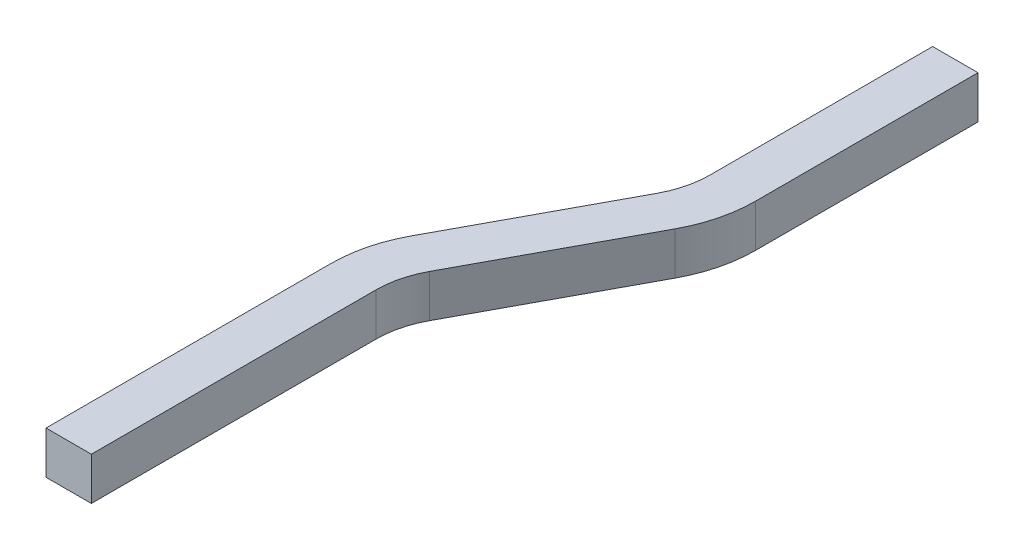
ISO-10303-21;
HEADER;
FILE_DESCRIPTION(('STEP AP214'),'2;1');
FILE_NAME('part.step','',(''),(''),'','','');
FILE_SCHEMA(('AUTOMOTIVE_DESIGN { 1 0 10303 214 1 1 1 1 }'));
ENDSEC;
DATA;
#1=APPLICATION_CONTEXT('core data for automotive mechanical design processes');
#2=APPLICATION_PROTOCOL_DEFINITION('international standard','automotive_design',2000,#1);
#3=PRODUCT_CONTEXT('',#1,'mechanical');
#4=PRODUCT('Part','Part','',(#3));
#5=PRODUCT_RELATED_PRODUCT_CATEGORY('part','',(#4));
#6=PRODUCT_DEFINITION_FORMATION('','',#4);
#7=PRODUCT_DEFINITION_CONTEXT('part definition',#1,'design');
#8=PRODUCT_DEFINITION('design','',#6,#7);
#9=PRODUCT_DEFINITION_SHAPE('','',#8);
#10=(LENGTH_UNIT() NAMED_UNIT(*) SI_UNIT(.MILLI.,.METRE.));
#11=(NAMED_UNIT(*) PLANE_ANGLE_UNIT() SI_UNIT($,.RADIAN.));
#12=(NAMED_UNIT(*) SI_UNIT($,.STERADIAN.) SOLID_ANGLE_UNIT());
#13=UNCERTAINTY_MEASURE_WITH_UNIT(LENGTH_MEASURE(1.E-05),#10,'distance_accuracy_value','');
#14=(GEOMETRIC_REPRESENTATION_CONTEXT(3) GLOBAL_UNCERTAINTY_ASSIGNED_CONTEXT((#13)) GLOBAL_UNIT_ASSIGNED_CONTEXT((#10,
#11,#12)) REPRESENTATION_CONTEXT('',''));
#15=CARTESIAN_POINT('',(0.,0.,0.));
#16=DIRECTION('',(0.,0.,1.));
#17=DIRECTION('',(1.,0.,0.));
#18=AXIS2_PLACEMENT_3D('',#15,#16,#17);
#19=CARTESIAN_POINT('',(-5.145,-0.239999999999999,-1.6));
#20=DIRECTION('',(0.,1.,0.));
#21=DIRECTION('',(0.,0.,1.));
#22=AXIS2_PLACEMENT_3D('',#19,#20,#21);
#23=PLANE('',#22);
#24=DIRECTION('',(1.,0.,0.));
#25=VECTOR('',#24,1.);
#26=CARTESIAN_POINT('',(-5.4,-0.24,0.));
#27=LINE('',#26,#25);
#28=CARTESIAN_POINT('',(-5.655,-0.24,0.));
#29=VERTEX_POINT('',#28);
#30=CARTESIAN_POINT('',(-5.145,-0.239999999999999,0.));
#31=VERTEX_POINT('',#30);
#32=EDGE_CURVE('E132',#29,#31,#27,.T.);
#33=ORIENTED_EDGE('',*,*,#32,.F.);
#34=DIRECTION('',(0.,0.,-1.));
#35=VECTOR('',#34,1.);
#36=CARTESIAN_POINT('',(-5.655,-0.24,-1.6));
#37=LINE('',#36,#35);
#38=CARTESIAN_POINT('',(-5.655,-0.239999999999999,-3.2));
#39=VERTEX_POINT('',#38);
#40=EDGE_CURVE('E116',#29,#39,#37,.T.);
#41=ORIENTED_EDGE('',*,*,#40,.T.);
#42=CARTESIAN_POINT('',(-4.13,-0.239999999999998,-3.2));
#43=DIRECTION('',(0.,-1.,0.));
#44=DIRECTION('',(0.,0.,-1.));
#45=AXIS2_PLACEMENT_3D('',#42,#43,#44);
#46=CIRCLE('',#45,1.525);
#47=CARTESIAN_POINT('',(-5.47289483523622,-0.239999999999998,-3.92267451975));
#48=VERTEX_POINT('',#47);
#49=EDGE_CURVE('E20',#48,#39,#46,.F.);
#50=ORIENTED_EDGE('',*,*,#49,.F.);
#51=DIRECTION('',(-0.473884930983608,0.,0.880586777204076));
#52=VECTOR('',#51,1.);
#53=CARTESIAN_POINT('',(-5.47289483523622,-0.239999999999998,-3.92267451975));
#54=LINE('',#53,#52);
#55=CARTESIAN_POINT('',(-4.50620442113786,-0.239999999999998,-5.71900679505164));
#56=VERTEX_POINT('',#55);
#57=EDGE_CURVE('E102',#56,#48,#54,.T.);
#58=ORIENTED_EDGE('',*,*,#57,.F.);
#59=CARTESIAN_POINT('',(-5.4,-0.239999999999998,-6.2));
#60=DIRECTION('',(0.,1.,0.));
#61=DIRECTION('',(0.,0.,1.));
#62=AXIS2_PLACEMENT_3D('',#59,#60,#61);
#63=CIRCLE('',#62,1.015);
#64=CARTESIAN_POINT('',(-4.385,-0.239999999999998,-6.2));
#65=VERTEX_POINT('',#64);
#66=EDGE_CURVE('E124',#56,#65,#63,.T.);
#67=ORIENTED_EDGE('',*,*,#66,.T.);
#68=DIRECTION('',(0.,0.,1.));
#69=VECTOR('',#68,1.);
#70=CARTESIAN_POINT('',(-4.385,-0.239999999999998,-6.2));
#71=LINE('',#70,#69);
#72=CARTESIAN_POINT('',(-4.385,-0.239999999999998,-8.7));
#73=VERTEX_POINT('',#72);
#74=EDGE_CURVE('E161',#73,#65,#71,.T.);
#75=ORIENTED_EDGE('',*,*,#74,.F.);
#76=DIRECTION('',(1.,0.,0.));
#77=VECTOR('',#76,1.);
#78=CARTESIAN_POINT('',(-4.13,-0.239999999999998,-8.7));
#79=LINE('',#78,#77);
#80=CARTESIAN_POINT('',(-3.875,-0.239999999999998,-8.7));
#81=VERTEX_POINT('',#80);
#82=EDGE_CURVE('E156',#73,#81,#79,.T.);
#83=ORIENTED_EDGE('',*,*,#82,.T.);
#84=DIRECTION('',(0.,0.,-1.));
#85=VECTOR('',#84,1.);
#86=CARTESIAN_POINT('',(-3.875,-0.239999999999998,-6.2));
#87=LINE('',#86,#85);
#88=CARTESIAN_POINT('',(-3.875,-0.239999999999998,-6.2));
#89=VERTEX_POINT('',#88);
#90=EDGE_CURVE('E149',#89,#81,#87,.T.);
#91=ORIENTED_EDGE('',*,*,#90,.F.);
#92=CARTESIAN_POINT('',(-5.4,-0.239999999999998,-6.2));
#93=DIRECTION('',(0.,1.,0.));
#94=DIRECTION('',(0.,0.,1.));
#95=AXIS2_PLACEMENT_3D('',#92,#93,#94);
#96=CIRCLE('',#95,1.525);
#97=CARTESIAN_POINT('',(-4.05710516476378,-0.239999999999998,-5.47732548025));
#98=VERTEX_POINT('',#97);
#99=EDGE_CURVE('E183',#98,#89,#96,.T.);
#100=ORIENTED_EDGE('',*,*,#99,.F.);
#101=DIRECTION('',(0.473884930983608,0.,-0.880586777204076));
#102=VECTOR('',#101,1.);
#103=CARTESIAN_POINT('',(-5.02379557886214,-0.239999999999998,-3.68099320494836));
#104=LINE('',#103,#102);
#105=CARTESIAN_POINT('',(-5.02379557886214,-0.239999999999998,-3.68099320494836));
#106=VERTEX_POINT('',#105);
#107=EDGE_CURVE('E144',#106,#98,#104,.T.);
#108=ORIENTED_EDGE('',*,*,#107,.F.);
#109=CARTESIAN_POINT('',(-4.13,-0.239999999999998,-3.2));
#110=DIRECTION('',(0.,-1.,0.));
#111=DIRECTION('',(0.,0.,-1.));
#112=AXIS2_PLACEMENT_3D('',#109,#110,#111);
#113=CIRCLE('',#112,1.015);
#114=CARTESIAN_POINT('',(-5.145,-0.239999999999998,-3.2));
#115=VERTEX_POINT('',#114);
#116=EDGE_CURVE('E147',#106,#115,#113,.F.);
#117=ORIENTED_EDGE('',*,*,#116,.T.);
#118=DIRECTION('',(0.,0.,1.));
#119=VECTOR('',#118,1.);
#120=CARTESIAN_POINT('',(-5.145,-0.239999999999998,-1.6));
#121=LINE('',#120,#119);
#122=EDGE_CURVE('E138',#115,#31,#121,.T.);
#123=ORIENTED_EDGE('',*,*,#122,.T.);
#124=EDGE_LOOP('',(#33,#41,#50,#58,#67,#75,#83,#91,#100,#108,#117,#123));
#125=FACE_BOUND('',#124,.T.);
#126=ADVANCED_FACE('F17',(#125),#23,.F.);
#127=CARTESIAN_POINT('',(-4.13,0.,-3.2));
#128=DIRECTION('',(0.,-1.,0.));
#129=DIRECTION('',(0.,0.,-1.));
#130=AXIS2_PLACEMENT_3D('',#127,#128,#129);
#131=CYLINDRICAL_SURFACE('',#130,1.525);
#132=DIRECTION('',(0.,1.,0.));
#133=VECTOR('',#132,1.);
#134=CARTESIAN_POINT('',(-5.655,-0.239999999999999,-3.2));
#135=LINE('',#134,#133);
#136=CARTESIAN_POINT('',(-5.655,0.240000000000001,-3.2));
#137=VERTEX_POINT('',#136);
#138=EDGE_CURVE('E129',#39,#137,#135,.T.);
#139=ORIENTED_EDGE('',*,*,#138,.T.);
#140=CARTESIAN_POINT('',(-4.13,0.240000000000002,-3.2));
#141=DIRECTION('',(0.,-1.,0.));
#142=DIRECTION('',(0.,0.,-1.));
#143=AXIS2_PLACEMENT_3D('',#140,#141,#142);
#144=CIRCLE('',#143,1.525);
#145=CARTESIAN_POINT('',(-5.47289483523622,0.240000000000001,-3.92267451975));
#146=VERTEX_POINT('',#145);
#147=EDGE_CURVE('E122',#137,#146,#144,.T.);
#148=ORIENTED_EDGE('',*,*,#147,.T.);
#149=DIRECTION('',(0.,1.,0.));
#150=VECTOR('',#149,1.);
#151=CARTESIAN_POINT('',(-5.47289483523622,0.240000000000002,-3.92267451975));
#152=LINE('',#151,#150);
#153=EDGE_CURVE('E107',#48,#146,#152,.T.);
#154=ORIENTED_EDGE('',*,*,#153,.F.);
#155=ORIENTED_EDGE('',*,*,#49,.T.);
#156=EDGE_LOOP('',(#139,#148,#154,#155));
#157=FACE_BOUND('',#156,.T.);
#158=ADVANCED_FACE('F121',(#157),#131,.T.);
#159=CARTESIAN_POINT('',(-5.47289483523622,0.240000000000002,-3.92267451975));
#160=DIRECTION('',(-0.880586777204076,0.,-0.473884930983608));
#161=DIRECTION('',(-0.473884930983608,0.,0.880586777204076));
#162=AXIS2_PLACEMENT_3D('',#159,#160,#161);
#163=PLANE('',#162);
#164=ORIENTED_EDGE('',*,*,#153,.T.);
#165=DIRECTION('',(0.473884930983608,0.,-0.880586777204076));
#166=VECTOR('',#165,1.);
#167=CARTESIAN_POINT('',(-5.47289483523622,0.240000000000001,-3.92267451975));
#168=LINE('',#167,#166);
#169=CARTESIAN_POINT('',(-4.50620442113786,0.240000000000002,-5.71900679505164));
#170=VERTEX_POINT('',#169);
#171=EDGE_CURVE('E179',#146,#170,#168,.T.);
#172=ORIENTED_EDGE('',*,*,#171,.T.);
#173=DIRECTION('',(0.,1.,0.));
#174=VECTOR('',#173,1.);
#175=CARTESIAN_POINT('',(-4.50620442113786,0.,-5.71900679505164));
#176=LINE('',#175,#174);
#177=EDGE_CURVE('E109',#170,#56,#176,.F.);
#178=ORIENTED_EDGE('',*,*,#177,.T.);
#179=ORIENTED_EDGE('',*,*,#57,.T.);
#180=EDGE_LOOP('',(#164,#172,#178,#179));
#181=FACE_BOUND('',#180,.T.);
#182=ADVANCED_FACE('F104',(#181),#163,.T.);
#183=CARTESIAN_POINT('',(-5.4,0.,-6.2));
#184=DIRECTION('',(0.,1.,0.));
#185=DIRECTION('',(0.,0.,1.));
#186=AXIS2_PLACEMENT_3D('',#183,#184,#185);
#187=CYLINDRICAL_SURFACE('',#186,1.015);
#188=ORIENTED_EDGE('',*,*,#66,.F.);
#189=ORIENTED_EDGE('',*,*,#177,.F.);
#190=CARTESIAN_POINT('',(-5.4,0.240000000000002,-6.2));
#191=DIRECTION('',(0.,1.,0.));
#192=DIRECTION('',(0.,0.,1.));
#193=AXIS2_PLACEMENT_3D('',#190,#191,#192);
#194=CIRCLE('',#193,1.015);
#195=CARTESIAN_POINT('',(-4.385,0.240000000000001,-6.2));
#196=VERTEX_POINT('',#195);
#197=EDGE_CURVE('E175',#170,#196,#194,.T.);
#198=ORIENTED_EDGE('',*,*,#197,.T.);
#199=DIRECTION('',(0.,1.,0.));
#200=VECTOR('',#199,1.);
#201=CARTESIAN_POINT('',(-4.385,0.240000000000002,-6.2));
#202=LINE('',#201,#200);
#203=EDGE_CURVE('E163',#65,#196,#202,.T.);
#204=ORIENTED_EDGE('',*,*,#203,.F.);
#205=EDGE_LOOP('',(#188,#189,#198,#204));
#206=FACE_BOUND('',#205,.T.);
#207=ADVANCED_FACE('F188',(#206),#187,.F.);
#208=CARTESIAN_POINT('',(-4.385,0.240000000000002,-6.2));
#209=DIRECTION('',(-1.,0.,0.));
#210=DIRECTION('',(0.,0.,1.));
#211=AXIS2_PLACEMENT_3D('',#208,#209,#210);
#212=PLANE('',#211);
#213=ORIENTED_EDGE('',*,*,#203,.T.);
#214=DIRECTION('',(0.,0.,-1.));
#215=VECTOR('',#214,1.);
#216=CARTESIAN_POINT('',(-4.385,0.240000000000001,-1.6));
#217=LINE('',#216,#215);
#218=CARTESIAN_POINT('',(-4.385,0.240000000000001,-8.7));
#219=VERTEX_POINT('',#218);
#220=EDGE_CURVE('E178',#196,#219,#217,.T.);
#221=ORIENTED_EDGE('',*,*,#220,.T.);
#222=DIRECTION('',(0.,1.,0.));
#223=VECTOR('',#222,1.);
#224=CARTESIAN_POINT('',(-4.385,0.,-8.7));
#225=LINE('',#224,#223);
#226=EDGE_CURVE('E158',#219,#73,#225,.F.);
#227=ORIENTED_EDGE('',*,*,#226,.T.);
#228=ORIENTED_EDGE('',*,*,#74,.T.);
#229=EDGE_LOOP('',(#213,#221,#227,#228));
#230=FACE_BOUND('',#229,.T.);
#231=ADVANCED_FACE('F264',(#230),#212,.T.);
#232=CARTESIAN_POINT('',(-4.13,0.,-8.7));
#233=DIRECTION('',(0.,0.,1.));
#234=DIRECTION('',(1.,0.,0.));
#235=AXIS2_PLACEMENT_3D('',#232,#233,#234);
#236=PLANE('',#235);
#237=DIRECTION('',(0.,1.,0.));
#238=VECTOR('',#237,1.);
#239=CARTESIAN_POINT('',(-3.875,-0.239999999999998,-8.7));
#240=LINE('',#239,#238);
#241=CARTESIAN_POINT('',(-3.875,0.240000000000001,-8.7));
#242=VERTEX_POINT('',#241);
#243=EDGE_CURVE('E153',#81,#242,#240,.T.);
#244=ORIENTED_EDGE('',*,*,#243,.F.);
#245=ORIENTED_EDGE('',*,*,#82,.F.);
#246=ORIENTED_EDGE('',*,*,#226,.F.);
#247=DIRECTION('',(1.,0.,0.));
#248=VECTOR('',#247,1.);
#249=CARTESIAN_POINT('',(-5.655,0.240000000000001,-8.7));
#250=LINE('',#249,#248);
#251=EDGE_CURVE('E200',#219,#242,#250,.T.);
#252=ORIENTED_EDGE('',*,*,#251,.T.);
#253=EDGE_LOOP('',(#244,#245,#246,#252));
#254=FACE_BOUND('',#253,.T.);
#255=ADVANCED_FACE('F263',(#254),#236,.F.);
#256=CARTESIAN_POINT('',(-3.875,-0.239999999999998,-6.2));
#257=DIRECTION('',(1.,0.,0.));
#258=DIRECTION('',(0.,0.,-1.));
#259=AXIS2_PLACEMENT_3D('',#256,#257,#258);
#260=PLANE('',#259);
#261=DIRECTION('',(0.,1.,0.));
#262=VECTOR('',#261,1.);
#263=CARTESIAN_POINT('',(-3.875,0.,-6.2));
#264=LINE('',#263,#262);
#265=CARTESIAN_POINT('',(-3.875,0.240000000000001,-6.2));
#266=VERTEX_POINT('',#265);
#267=EDGE_CURVE('E152',#89,#266,#264,.T.);
#268=ORIENTED_EDGE('',*,*,#267,.F.);
#269=ORIENTED_EDGE('',*,*,#90,.T.);
#270=ORIENTED_EDGE('',*,*,#243,.T.);
#271=DIRECTION('',(0.,0.,-1.));
#272=VECTOR('',#271,1.);
#273=CARTESIAN_POINT('',(-3.875,0.240000000000001,-1.6));
#274=LINE('',#273,#272);
#275=EDGE_CURVE('E174',#242,#266,#274,.F.);
#276=ORIENTED_EDGE('',*,*,#275,.T.);
#277=EDGE_LOOP('',(#268,#269,#270,#276));
#278=FACE_BOUND('',#277,.T.);
#279=ADVANCED_FACE('F259',(#278),#260,.T.);
#280=CARTESIAN_POINT('',(-5.4,0.,-6.2));
#281=DIRECTION('',(0.,1.,0.));
#282=DIRECTION('',(0.,0.,1.));
#283=AXIS2_PLACEMENT_3D('',#280,#281,#282);
#284=CYLINDRICAL_SURFACE('',#283,1.525);
#285=DIRECTION('',(0.,1.,0.));
#286=VECTOR('',#285,1.);
#287=CARTESIAN_POINT('',(-4.05710516476378,-0.239999999999998,-5.47732548025));
#288=LINE('',#287,#286);
#289=CARTESIAN_POINT('',(-4.05710516476379,0.240000000000001,-5.47732548025));
#290=VERTEX_POINT('',#289);
#291=EDGE_CURVE('E148',#98,#290,#288,.T.);
#292=ORIENTED_EDGE('',*,*,#291,.F.);
#293=ORIENTED_EDGE('',*,*,#99,.T.);
#294=ORIENTED_EDGE('',*,*,#267,.T.);
#295=CARTESIAN_POINT('',(-5.4,0.240000000000002,-6.2));
#296=DIRECTION('',(0.,1.,0.));
#297=DIRECTION('',(0.,0.,1.));
#298=AXIS2_PLACEMENT_3D('',#295,#296,#297);
#299=CIRCLE('',#298,1.525);
#300=EDGE_CURVE('E171',#266,#290,#299,.F.);
#301=ORIENTED_EDGE('',*,*,#300,.T.);
#302=EDGE_LOOP('',(#292,#293,#294,#301));
#303=FACE_BOUND('',#302,.T.);
#304=ADVANCED_FACE('F256',(#303),#284,.T.);
#305=CARTESIAN_POINT('',(-5.02379557886214,-0.239999999999998,-3.68099320494836));
#306=DIRECTION('',(0.880586777204076,0.,0.473884930983608));
#307=DIRECTION('',(0.473884930983608,0.,-0.880586777204076));
#308=AXIS2_PLACEMENT_3D('',#305,#306,#307);
#309=PLANE('',#308);
#310=DIRECTION('',(0.,-1.,0.));
#311=VECTOR('',#310,1.);
#312=CARTESIAN_POINT('',(-5.02379557886214,0.,-3.68099320494836));
#313=LINE('',#312,#311);
#314=CARTESIAN_POINT('',(-5.02379557886214,0.240000000000001,-3.68099320494836));
#315=VERTEX_POINT('',#314);
#316=EDGE_CURVE('E141',#315,#106,#313,.T.);
#317=ORIENTED_EDGE('',*,*,#316,.T.);
#318=ORIENTED_EDGE('',*,*,#107,.T.);
#319=ORIENTED_EDGE('',*,*,#291,.T.);
#320=DIRECTION('',(-0.473884930983608,0.,0.880586777204076));
#321=VECTOR('',#320,1.);
#322=CARTESIAN_POINT('',(-4.05710516476379,0.240000000000001,-5.47732548025));
#323=LINE('',#322,#321);
#324=EDGE_CURVE('E170',#290,#315,#323,.T.);
#325=ORIENTED_EDGE('',*,*,#324,.T.);
#326=EDGE_LOOP('',(#317,#318,#319,#325));
#327=FACE_BOUND('',#326,.T.);
#328=ADVANCED_FACE('F251',(#327),#309,.T.);
#329=CARTESIAN_POINT('',(-4.13,0.,-3.2));
#330=DIRECTION('',(0.,-1.,0.));
#331=DIRECTION('',(0.,0.,-1.));
#332=AXIS2_PLACEMENT_3D('',#329,#330,#331);
#333=CYLINDRICAL_SURFACE('',#332,1.015);
#334=CARTESIAN_POINT('',(-4.13,0.240000000000002,-3.2));
#335=DIRECTION('',(0.,-1.,0.));
#336=DIRECTION('',(0.,0.,-1.));
#337=AXIS2_PLACEMENT_3D('',#334,#335,#336);
#338=CIRCLE('',#337,1.015);
#339=CARTESIAN_POINT('',(-5.145,0.240000000000002,-3.2));
#340=VERTEX_POINT('',#339);
#341=EDGE_CURVE('E166',#315,#340,#338,.F.);
#342=ORIENTED_EDGE('',*,*,#341,.T.);
#343=DIRECTION('',(0.,1.,0.));
#344=VECTOR('',#343,1.);
#345=CARTESIAN_POINT('',(-5.145,0.240000000000001,-3.2));
#346=LINE('',#345,#344);
#347=EDGE_CURVE('E135',#340,#115,#346,.F.);
#348=ORIENTED_EDGE('',*,*,#347,.T.);
#349=ORIENTED_EDGE('',*,*,#116,.F.);
#350=ORIENTED_EDGE('',*,*,#316,.F.);
#351=EDGE_LOOP('',(#342,#348,#349,#350));
#352=FACE_BOUND('',#351,.T.);
#353=ADVANCED_FACE('F248',(#352),#333,.F.);
#354=CARTESIAN_POINT('',(-5.145,0.240000000000001,-1.6));
#355=DIRECTION('',(-1.,0.,0.));
#356=DIRECTION('',(0.,0.,1.));
#357=AXIS2_PLACEMENT_3D('',#354,#355,#356);
#358=PLANE('',#357);
#359=DIRECTION('',(0.,0.,-1.));
#360=VECTOR('',#359,1.);
#361=CARTESIAN_POINT('',(-5.145,0.240000000000001,-1.6));
#362=LINE('',#361,#360);
#363=CARTESIAN_POINT('',(-5.145,0.240000000000001,0.));
#364=VERTEX_POINT('',#363);
#365=EDGE_CURVE('E169',#340,#364,#362,.F.);
#366=ORIENTED_EDGE('',*,*,#365,.T.);
#367=DIRECTION('',(0.,1.,0.));
#368=VECTOR('',#367,1.);
#369=CARTESIAN_POINT('',(-5.145,-0.24,0.));
#370=LINE('',#369,#368);
#371=EDGE_CURVE('E134',#31,#364,#370,.T.);
#372=ORIENTED_EDGE('',*,*,#371,.F.);
#373=ORIENTED_EDGE('',*,*,#122,.F.);
#374=ORIENTED_EDGE('',*,*,#347,.F.);
#375=EDGE_LOOP('',(#366,#372,#373,#374));
#376=FACE_BOUND('',#375,.T.);
#377=ADVANCED_FACE('F241',(#376),#358,.F.);
#378=CARTESIAN_POINT('',(-5.4,-0.24,0.));
#379=DIRECTION('',(0.,0.,1.));
#380=DIRECTION('',(1.,0.,0.));
#381=AXIS2_PLACEMENT_3D('',#378,#379,#380);
#382=PLANE('',#381);
#383=ORIENTED_EDGE('',*,*,#371,.T.);
#384=DIRECTION('',(1.,0.,0.));
#385=VECTOR('',#384,1.);
#386=CARTESIAN_POINT('',(-5.655,0.240000000000001,0.));
#387=LINE('',#386,#385);
#388=CARTESIAN_POINT('',(-5.655,0.240000000000001,0.));
#389=VERTEX_POINT('',#388);
#390=EDGE_CURVE('E26',#364,#389,#387,.F.);
#391=ORIENTED_EDGE('',*,*,#390,.T.);
#392=DIRECTION('',(0.,1.,0.));
#393=VECTOR('',#392,1.);
#394=CARTESIAN_POINT('',(-5.655,-0.239999999999999,0.));
#395=LINE('',#394,#393);
#396=EDGE_CURVE('E34',#389,#29,#395,.F.);
#397=ORIENTED_EDGE('',*,*,#396,.T.);
#398=ORIENTED_EDGE('',*,*,#32,.T.);
#399=EDGE_LOOP('',(#383,#391,#397,#398));
#400=FACE_BOUND('',#399,.T.);
#401=ADVANCED_FACE('F267',(#400),#382,.T.);
#402=CARTESIAN_POINT('',(-5.655,-0.239999999999999,-1.6));
#403=DIRECTION('',(1.,0.,0.));
#404=DIRECTION('',(0.,0.,-1.));
#405=AXIS2_PLACEMENT_3D('',#402,#403,#404);
#406=PLANE('',#405);
#407=ORIENTED_EDGE('',*,*,#40,.F.);
#408=ORIENTED_EDGE('',*,*,#396,.F.);
#409=DIRECTION('',(0.,0.,-1.));
#410=VECTOR('',#409,1.);
#411=CARTESIAN_POINT('',(-5.655,0.240000000000001,-1.6));
#412=LINE('',#411,#410);
#413=EDGE_CURVE('E11',#389,#137,#412,.T.);
#414=ORIENTED_EDGE('',*,*,#413,.T.);
#415=ORIENTED_EDGE('',*,*,#138,.F.);
#416=EDGE_LOOP('',(#407,#408,#414,#415));
#417=FACE_BOUND('',#416,.T.);
#418=ADVANCED_FACE('F265',(#417),#406,.F.);
#419=CARTESIAN_POINT('',(-5.655,0.240000000000001,-1.6));
#420=DIRECTION('',(0.,-1.,0.));
#421=DIRECTION('',(0.,0.,-1.));
#422=AXIS2_PLACEMENT_3D('',#419,#420,#421);
#423=PLANE('',#422);
#424=ORIENTED_EDGE('',*,*,#390,.F.);
#425=ORIENTED_EDGE('',*,*,#365,.F.);
#426=ORIENTED_EDGE('',*,*,#341,.F.);
#427=ORIENTED_EDGE('',*,*,#324,.F.);
#428=ORIENTED_EDGE('',*,*,#300,.F.);
#429=ORIENTED_EDGE('',*,*,#275,.F.);
#430=ORIENTED_EDGE('',*,*,#251,.F.);
#431=ORIENTED_EDGE('',*,*,#220,.F.);
#432=ORIENTED_EDGE('',*,*,#197,.F.);
#433=ORIENTED_EDGE('',*,*,#171,.F.);
#434=ORIENTED_EDGE('',*,*,#147,.F.);
#435=ORIENTED_EDGE('',*,*,#413,.F.);
#436=EDGE_LOOP('',(#424,#425,#426,#427,#428,#429,#430,#431,#432,#433,#434,#435));
#437=FACE_BOUND('',#436,.T.);
#438=ADVANCED_FACE('F245',(#437),#423,.F.);
#439=CLOSED_SHELL('',(#126,#158,#182,#207,#231,#255,#279,#304,#328,#353,#377,#401,#418,#438));
#440=MANIFOLD_SOLID_BREP('B1',#439);
#441=ADVANCED_BREP_SHAPE_REPRESENTATION('',(#18,#440),#14);
#442=SHAPE_DEFINITION_REPRESENTATION(#9,#441);
ENDSEC;
END-ISO-10303-21;
